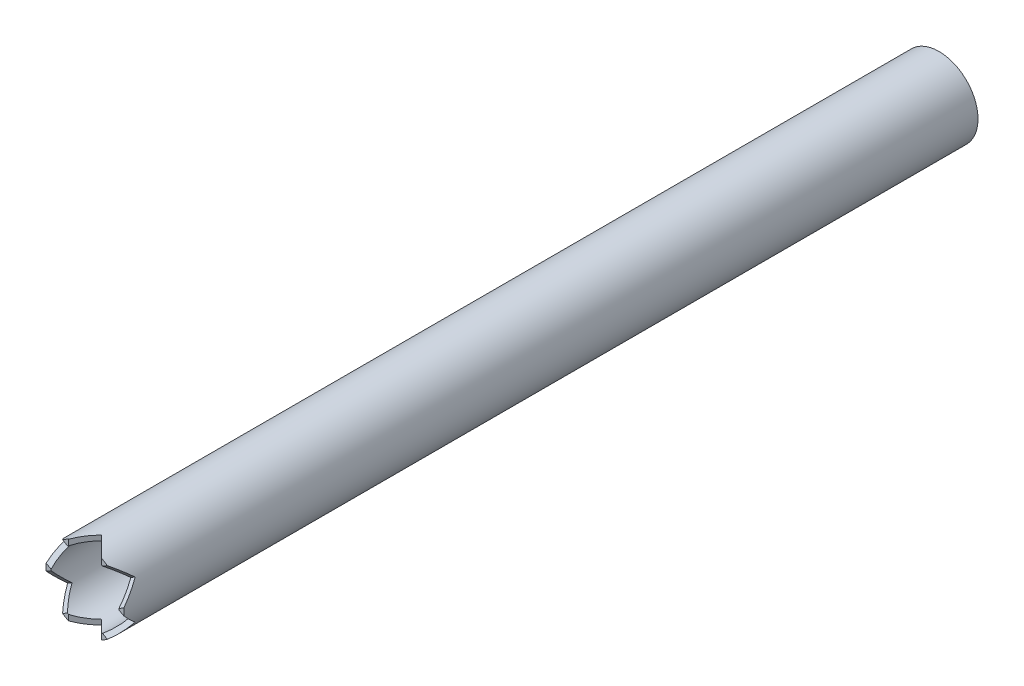
ISO-10303-21;
HEADER;
FILE_DESCRIPTION(('STEP AP214'),'2;1');
FILE_NAME('part.step','',(''),(''),'','','');
FILE_SCHEMA(('AUTOMOTIVE_DESIGN { 1 0 10303 214 1 1 1 1 }'));
ENDSEC;
DATA;
#1=APPLICATION_CONTEXT('core data for automotive mechanical design processes');
#2=APPLICATION_PROTOCOL_DEFINITION('international standard','automotive_design',2000,#1);
#3=PRODUCT_CONTEXT('',#1,'mechanical');
#4=PRODUCT('Part','Part','',(#3));
#5=PRODUCT_RELATED_PRODUCT_CATEGORY('part','',(#4));
#6=PRODUCT_DEFINITION_FORMATION('','',#4);
#7=PRODUCT_DEFINITION_CONTEXT('part definition',#1,'design');
#8=PRODUCT_DEFINITION('design','',#6,#7);
#9=PRODUCT_DEFINITION_SHAPE('','',#8);
#10=(LENGTH_UNIT() NAMED_UNIT(*) SI_UNIT(.MILLI.,.METRE.));
#11=(NAMED_UNIT(*) PLANE_ANGLE_UNIT() SI_UNIT($,.RADIAN.));
#12=(NAMED_UNIT(*) SI_UNIT($,.STERADIAN.) SOLID_ANGLE_UNIT());
#13=UNCERTAINTY_MEASURE_WITH_UNIT(LENGTH_MEASURE(1.E-05),#10,'distance_accuracy_value','');
#14=(GEOMETRIC_REPRESENTATION_CONTEXT(3) GLOBAL_UNCERTAINTY_ASSIGNED_CONTEXT((#13)) GLOBAL_UNIT_ASSIGNED_CONTEXT((#10,
#11,#12)) REPRESENTATION_CONTEXT('',''));
#15=CARTESIAN_POINT('',(0.,0.,0.));
#16=DIRECTION('',(0.,0.,1.));
#17=DIRECTION('',(1.,0.,0.));
#18=AXIS2_PLACEMENT_3D('',#15,#16,#17);
#19=CARTESIAN_POINT('',(0.,0.,0.));
#20=DIRECTION('',(0.,0.,-1.));
#21=DIRECTION('',(-1.,0.,0.));
#22=AXIS2_PLACEMENT_3D('',#19,#20,#21);
#23=PLANE('',#22);
#24=CARTESIAN_POINT('',(0.,0.,0.));
#25=DIRECTION('',(0.,0.,-1.));
#26=DIRECTION('',(-1.,0.,0.));
#27=AXIS2_PLACEMENT_3D('',#24,#25,#26);
#28=CIRCLE('',#27,30.1625);
#29=CARTESIAN_POINT('',(30.0431383461014,2.68071717400603,0.));
#30=VERTEX_POINT('',#29);
#31=CARTESIAN_POINT('',(30.0431383461014,-2.68071717400645,0.));
#32=VERTEX_POINT('',#31);
#33=EDGE_CURVE('E264',#30,#32,#28,.T.);
#34=ORIENTED_EDGE('',*,*,#33,.F.);
#35=DIRECTION('',(-0.866025403784443,-0.499999999999992,0.));
#36=VECTOR('',#35,1.);
#37=CARTESIAN_POINT('',(42.0326206208241,9.60284799276126,0.));
#38=LINE('',#37,#36);
#39=CARTESIAN_POINT('',(26.2463517537135,0.488641412835382,0.));
#40=VERTEX_POINT('',#39);
#41=EDGE_CURVE('E353',#30,#40,#38,.T.);
#42=ORIENTED_EDGE('',*,*,#41,.T.);
#43=CARTESIAN_POINT('',(0.,0.,0.));
#44=DIRECTION('',(0.,0.,-1.));
#45=DIRECTION('',(-1.,0.,0.));
#46=AXIS2_PLACEMENT_3D('',#43,#44,#45);
#47=CIRCLE('',#46,26.2509);
#48=CARTESIAN_POINT('',(26.2463517537135,-0.48864141283575,0.));
#49=VERTEX_POINT('',#48);
#50=EDGE_CURVE('E197',#40,#49,#47,.T.);
#51=ORIENTED_EDGE('',*,*,#50,.T.);
#52=DIRECTION('',(0.866025403784436,-0.500000000000004,0.));
#53=VECTOR('',#52,1.);
#54=CARTESIAN_POINT('',(-29.332620620824,31.5998932488866,0.));
#55=LINE('',#54,#53);
#56=EDGE_CURVE('E201',#49,#32,#55,.T.);
#57=ORIENTED_EDGE('',*,*,#56,.T.);
#58=EDGE_LOOP('',(#34,#42,#51,#57));
#59=FACE_BOUND('',#58,.T.);
#60=ADVANCED_FACE('F51',(#59),#23,.F.);
#61=CARTESIAN_POINT('',(-12.7,-22.974328081796,0.));
#62=VERTEX_POINT('',#61);
#63=CARTESIAN_POINT('',(-13.5463517537138,-22.4856866689602,0.));
#64=VERTEX_POINT('',#63);
#65=EDGE_CURVE('E253',#62,#64,#47,.T.);
#66=ORIENTED_EDGE('',*,*,#65,.T.);
#67=DIRECTION('',(-0.866025403784443,-0.499999999999992,0.));
#68=VECTOR('',#67,1.);
#69=CARTESIAN_POINT('',(6.3499999999999,-10.9985226280624,0.));
#70=LINE('',#69,#68);
#71=CARTESIAN_POINT('',(-17.3431383461016,-24.6777624301309,0.));
#72=VERTEX_POINT('',#71);
#73=EDGE_CURVE('E14',#64,#72,#70,.T.);
#74=ORIENTED_EDGE('',*,*,#73,.T.);
#75=CARTESIAN_POINT('',(-12.7,-27.3584796041374,0.));
#76=VERTEX_POINT('',#75);
#77=EDGE_CURVE('E259',#76,#72,#28,.T.);
#78=ORIENTED_EDGE('',*,*,#77,.F.);
#79=DIRECTION('',(0.,1.,0.));
#80=VECTOR('',#79,1.);
#81=CARTESIAN_POINT('',(-12.7,0.,0.));
#82=LINE('',#81,#80);
#83=EDGE_CURVE('E267',#76,#62,#82,.T.);
#84=ORIENTED_EDGE('',*,*,#83,.T.);
#85=EDGE_LOOP('',(#66,#74,#78,#84));
#86=FACE_BOUND('',#85,.T.);
#87=ADVANCED_FACE('F308',(#86),#23,.F.);
#88=CARTESIAN_POINT('',(12.7,22.974328081796,0.));
#89=VERTEX_POINT('',#88);
#90=CARTESIAN_POINT('',(13.5463517537138,22.4856866689602,0.));
#91=VERTEX_POINT('',#90);
#92=EDGE_CURVE('E258',#89,#91,#47,.T.);
#93=ORIENTED_EDGE('',*,*,#92,.T.);
#94=DIRECTION('',(-0.866025403784443,-0.499999999999992,0.));
#95=VECTOR('',#94,1.);
#96=CARTESIAN_POINT('',(29.3326206208243,31.5998932488861,0.));
#97=LINE('',#96,#95);
#98=CARTESIAN_POINT('',(17.3431383461016,24.6777624301309,0.));
#99=VERTEX_POINT('',#98);
#100=EDGE_CURVE('E178',#99,#91,#97,.T.);
#101=ORIENTED_EDGE('',*,*,#100,.F.);
#102=CARTESIAN_POINT('',(12.7,27.3584796041374,0.));
#103=VERTEX_POINT('',#102);
#104=EDGE_CURVE('E249',#103,#99,#28,.T.);
#105=ORIENTED_EDGE('',*,*,#104,.F.);
#106=DIRECTION('',(0.,-1.,0.));
#107=VECTOR('',#106,1.);
#108=CARTESIAN_POINT('',(12.7,0.,0.));
#109=LINE('',#108,#107);
#110=EDGE_CURVE('E271',#103,#89,#109,.T.);
#111=ORIENTED_EDGE('',*,*,#110,.T.);
#112=EDGE_LOOP('',(#93,#101,#105,#111));
#113=FACE_BOUND('',#112,.T.);
#114=ADVANCED_FACE('F313',(#113),#23,.F.);
#115=CARTESIAN_POINT('',(-17.3431383461013,24.6777624301311,0.));
#116=VERTEX_POINT('',#115);
#117=CARTESIAN_POINT('',(-12.7,27.3584796041374,0.));
#118=VERTEX_POINT('',#117);
#119=EDGE_CURVE('E289',#116,#118,#28,.T.);
#120=ORIENTED_EDGE('',*,*,#119,.F.);
#121=DIRECTION('',(0.866025403784436,-0.500000000000004,0.));
#122=VECTOR('',#121,1.);
#123=CARTESIAN_POINT('',(6.35000000000005,10.9985226280623,0.));
#124=LINE('',#123,#122);
#125=CARTESIAN_POINT('',(-13.5463517537134,22.4856866689604,0.));
#126=VERTEX_POINT('',#125);
#127=EDGE_CURVE('E275',#116,#126,#124,.T.);
#128=ORIENTED_EDGE('',*,*,#127,.T.);
#129=CARTESIAN_POINT('',(-12.7,22.974328081796,0.));
#130=VERTEX_POINT('',#129);
#131=EDGE_CURVE('E286',#126,#130,#47,.T.);
#132=ORIENTED_EDGE('',*,*,#131,.T.);
#133=EDGE_CURVE('E252',#130,#118,#82,.T.);
#134=ORIENTED_EDGE('',*,*,#133,.T.);
#135=EDGE_LOOP('',(#120,#128,#132,#134));
#136=FACE_BOUND('',#135,.T.);
#137=ADVANCED_FACE('F330',(#136),#23,.F.);
#138=CARTESIAN_POINT('',(17.3431383461013,-24.6777624301311,0.));
#139=VERTEX_POINT('',#138);
#140=CARTESIAN_POINT('',(12.7,-27.3584796041374,0.));
#141=VERTEX_POINT('',#140);
#142=EDGE_CURVE('E262',#139,#141,#28,.T.);
#143=ORIENTED_EDGE('',*,*,#142,.F.);
#144=DIRECTION('',(0.866025403784436,-0.500000000000004,0.));
#145=VECTOR('',#144,1.);
#146=CARTESIAN_POINT('',(-42.0326206208241,9.60284799276193,0.));
#147=LINE('',#146,#145);
#148=CARTESIAN_POINT('',(13.5463517537135,-22.4856866689604,0.));
#149=VERTEX_POINT('',#148);
#150=EDGE_CURVE('E209',#149,#139,#147,.T.);
#151=ORIENTED_EDGE('',*,*,#150,.F.);
#152=CARTESIAN_POINT('',(12.7,-22.974328081796,0.));
#153=VERTEX_POINT('',#152);
#154=EDGE_CURVE('E256',#149,#153,#47,.T.);
#155=ORIENTED_EDGE('',*,*,#154,.T.);
#156=EDGE_CURVE('E268',#153,#141,#109,.T.);
#157=ORIENTED_EDGE('',*,*,#156,.T.);
#158=EDGE_LOOP('',(#143,#151,#155,#157));
#159=FACE_BOUND('',#158,.T.);
#160=ADVANCED_FACE('F319',(#159),#23,.F.);
#161=CARTESIAN_POINT('',(0.,0.,-660.4));
#162=DIRECTION('',(0.,0.,1.));
#163=DIRECTION('',(1.,0.,0.));
#164=AXIS2_PLACEMENT_3D('',#161,#162,#163);
#165=CYLINDRICAL_SURFACE('',#164,26.2509);
#166=CARTESIAN_POINT('',(0.,0.,-12.7));
#167=DIRECTION('',(0.353553390593268,-0.612372435695798,-0.707106781186548));
#168=DIRECTION('',(0.353553390593268,-0.612372435695798,0.707106781186548));
#169=AXIS2_PLACEMENT_3D('',#166,#167,#168);
#170=ELLIPSE('',#169,37.1243788044999,26.2509);
#171=CARTESIAN_POINT('',(22.733946272205,13.1254499999998,-12.7));
#172=VERTEX_POINT('',#171);
#173=EDGE_CURVE('E187',#172,#40,#170,.T.);
#174=ORIENTED_EDGE('',*,*,#173,.F.);
#175=CARTESIAN_POINT('',(0.,0.,-12.7));
#176=DIRECTION('',(-0.353553390593268,0.612372435695798,-0.707106781186548));
#177=DIRECTION('',(-0.353553390593268,0.612372435695798,0.707106781186548));
#178=AXIS2_PLACEMENT_3D('',#175,#176,#177);
#179=ELLIPSE('',#178,37.1243788044999,26.2509);
#180=EDGE_CURVE('E175',#91,#172,#179,.T.);
#181=ORIENTED_EDGE('',*,*,#180,.F.);
#182=ORIENTED_EDGE('',*,*,#92,.F.);
#183=CARTESIAN_POINT('',(0.,0.,-12.7));
#184=DIRECTION('',(0.707106781186548,0.,-0.707106781186548));
#185=DIRECTION('',(0.707106781186548,0.,0.707106781186548));
#186=AXIS2_PLACEMENT_3D('',#183,#184,#185);
#187=ELLIPSE('',#186,37.1243788044999,26.2509);
#188=CARTESIAN_POINT('',(0.,26.2509,-12.7));
#189=VERTEX_POINT('',#188);
#190=EDGE_CURVE('E242',#189,#89,#187,.T.);
#191=ORIENTED_EDGE('',*,*,#190,.F.);
#192=CARTESIAN_POINT('',(0.,0.,-12.7));
#193=DIRECTION('',(-0.707106781186548,0.,-0.707106781186548));
#194=DIRECTION('',(-0.707106781186548,0.,0.707106781186548));
#195=AXIS2_PLACEMENT_3D('',#192,#193,#194);
#196=ELLIPSE('',#195,37.1243788044999,26.2509);
#197=EDGE_CURVE('E237',#130,#189,#196,.T.);
#198=ORIENTED_EDGE('',*,*,#197,.F.);
#199=ORIENTED_EDGE('',*,*,#131,.F.);
#200=CARTESIAN_POINT('',(0.,0.,-12.7));
#201=DIRECTION('',(0.353553390593277,0.612372435695793,-0.707106781186548));
#202=DIRECTION('',(0.353553390593277,0.612372435695793,0.707106781186547));
#203=AXIS2_PLACEMENT_3D('',#200,#201,#202);
#204=ELLIPSE('',#203,37.1243788044999,26.2509);
#205=CARTESIAN_POINT('',(-22.7339462722049,13.1254500000001,-12.7));
#206=VERTEX_POINT('',#205);
#207=EDGE_CURVE('E224',#206,#126,#204,.T.);
#208=ORIENTED_EDGE('',*,*,#207,.F.);
#209=CARTESIAN_POINT('',(0.,0.,-12.7));
#210=DIRECTION('',(-0.353553390593277,-0.612372435695793,-0.707106781186548));
#211=DIRECTION('',(-0.353553390593277,-0.612372435695793,0.707106781186547));
#212=AXIS2_PLACEMENT_3D('',#209,#210,#211);
#213=ELLIPSE('',#212,37.1243788044999,26.2509);
#214=CARTESIAN_POINT('',(-26.2463517537135,0.48864141283575,0.));
#215=VERTEX_POINT('',#214);
#216=EDGE_CURVE('E219',#215,#206,#213,.T.);
#217=ORIENTED_EDGE('',*,*,#216,.F.);
#218=CARTESIAN_POINT('',(-26.2463517537135,-0.488641412835389,0.));
#219=VERTEX_POINT('',#218);
#220=EDGE_CURVE('E257',#219,#215,#47,.T.);
#221=ORIENTED_EDGE('',*,*,#220,.F.);
#222=CARTESIAN_POINT('',(-22.733946272205,-13.1254499999998,-12.7));
#223=VERTEX_POINT('',#222);
#224=EDGE_CURVE('E74',#223,#219,#179,.T.);
#225=ORIENTED_EDGE('',*,*,#224,.F.);
#226=EDGE_CURVE('E198',#64,#223,#170,.T.);
#227=ORIENTED_EDGE('',*,*,#226,.F.);
#228=ORIENTED_EDGE('',*,*,#65,.F.);
#229=CARTESIAN_POINT('',(0.,-26.2509,-12.7));
#230=VERTEX_POINT('',#229);
#231=EDGE_CURVE('E235',#230,#62,#196,.T.);
#232=ORIENTED_EDGE('',*,*,#231,.F.);
#233=EDGE_CURVE('E244',#153,#230,#187,.T.);
#234=ORIENTED_EDGE('',*,*,#233,.F.);
#235=ORIENTED_EDGE('',*,*,#154,.F.);
#236=CARTESIAN_POINT('',(22.7339462722048,-13.1254500000001,-12.7));
#237=VERTEX_POINT('',#236);
#238=EDGE_CURVE('E217',#237,#149,#213,.T.);
#239=ORIENTED_EDGE('',*,*,#238,.F.);
#240=EDGE_CURVE('E226',#49,#237,#204,.T.);
#241=ORIENTED_EDGE('',*,*,#240,.F.);
#242=ORIENTED_EDGE('',*,*,#50,.F.);
#243=EDGE_LOOP('',(#174,#181,#182,#191,#198,#199,#208,#217,#221,#225,#227,#228,#232,#234,#235,
#239,#241,#242));
#244=FACE_BOUND('',#243,.T.);
#245=CARTESIAN_POINT('',(0.,0.,-660.4));
#246=DIRECTION('',(0.,0.,-1.));
#247=DIRECTION('',(-1.,0.,0.));
#248=AXIS2_PLACEMENT_3D('',#245,#246,#247);
#249=CIRCLE('',#248,26.2509);
#250=CARTESIAN_POINT('',(-26.2509,0.,-660.4));
#251=VERTEX_POINT('',#250);
#252=EDGE_CURVE('E245',#251,#251,#249,.T.);
#253=ORIENTED_EDGE('',*,*,#252,.T.);
#254=EDGE_LOOP('',(#253));
#255=FACE_BOUND('',#254,.T.);
#256=ADVANCED_FACE('F53',(#244,#255),#165,.F.);
#257=CARTESIAN_POINT('',(0.,0.,-660.4));
#258=DIRECTION('',(0.,0.,1.));
#259=DIRECTION('',(1.,0.,0.));
#260=AXIS2_PLACEMENT_3D('',#257,#258,#259);
#261=CYLINDRICAL_SURFACE('',#260,30.1625);
#262=CARTESIAN_POINT('',(0.,0.,-660.4));
#263=DIRECTION('',(0.,0.,-1.));
#264=DIRECTION('',(-1.,0.,0.));
#265=AXIS2_PLACEMENT_3D('',#262,#263,#264);
#266=CIRCLE('',#265,30.1625);
#267=CARTESIAN_POINT('',(-30.1625,0.,-660.4));
#268=VERTEX_POINT('',#267);
#269=EDGE_CURVE('E248',#268,#268,#266,.T.);
#270=ORIENTED_EDGE('',*,*,#269,.F.);
#271=EDGE_LOOP('',(#270));
#272=FACE_BOUND('',#271,.T.);
#273=CARTESIAN_POINT('',(0.,0.,-12.7));
#274=DIRECTION('',(-0.353553390593268,0.612372435695798,-0.707106781186548));
#275=DIRECTION('',(-0.353553390593268,0.612372435695798,0.707106781186548));
#276=AXIS2_PLACEMENT_3D('',#273,#274,#275);
#277=ELLIPSE('',#276,42.6562165750785,30.1625);
#278=CARTESIAN_POINT('',(26.1214912416483,15.0812499999998,-12.7));
#279=VERTEX_POINT('',#278);
#280=EDGE_CURVE('E357',#99,#279,#277,.T.);
#281=ORIENTED_EDGE('',*,*,#280,.T.);
#282=CARTESIAN_POINT('',(0.,0.,-12.7));
#283=DIRECTION('',(0.353553390593268,-0.612372435695798,-0.707106781186548));
#284=DIRECTION('',(0.353553390593268,-0.612372435695798,0.707106781186548));
#285=AXIS2_PLACEMENT_3D('',#282,#283,#284);
#286=ELLIPSE('',#285,42.6562165750785,30.1625);
#287=EDGE_CURVE('E183',#279,#30,#286,.T.);
#288=ORIENTED_EDGE('',*,*,#287,.T.);
#289=ORIENTED_EDGE('',*,*,#33,.T.);
#290=CARTESIAN_POINT('',(0.,0.,-12.7));
#291=DIRECTION('',(0.353553390593277,0.612372435695793,-0.707106781186548));
#292=DIRECTION('',(0.353553390593277,0.612372435695793,0.707106781186547));
#293=AXIS2_PLACEMENT_3D('',#290,#291,#292);
#294=ELLIPSE('',#293,42.6562165750785,30.1625);
#295=CARTESIAN_POINT('',(26.1214912416481,-15.0812500000001,-12.7));
#296=VERTEX_POINT('',#295);
#297=EDGE_CURVE('E223',#32,#296,#294,.T.);
#298=ORIENTED_EDGE('',*,*,#297,.T.);
#299=CARTESIAN_POINT('',(0.,0.,-12.7));
#300=DIRECTION('',(-0.353553390593277,-0.612372435695793,-0.707106781186548));
#301=DIRECTION('',(-0.353553390593277,-0.612372435695793,0.707106781186547));
#302=AXIS2_PLACEMENT_3D('',#299,#300,#301);
#303=ELLIPSE('',#302,42.6562165750785,30.1625);
#304=EDGE_CURVE('E213',#296,#139,#303,.T.);
#305=ORIENTED_EDGE('',*,*,#304,.T.);
#306=ORIENTED_EDGE('',*,*,#142,.T.);
#307=CARTESIAN_POINT('',(0.,0.,-12.7));
#308=DIRECTION('',(0.707106781186548,0.,-0.707106781186548));
#309=DIRECTION('',(0.707106781186548,0.,0.707106781186548));
#310=AXIS2_PLACEMENT_3D('',#307,#308,#309);
#311=ELLIPSE('',#310,42.6562165750785,30.1625);
#312=CARTESIAN_POINT('',(0.,-30.1625,-12.7));
#313=VERTEX_POINT('',#312);
#314=EDGE_CURVE('E241',#141,#313,#311,.T.);
#315=ORIENTED_EDGE('',*,*,#314,.T.);
#316=CARTESIAN_POINT('',(0.,0.,-12.7));
#317=DIRECTION('',(-0.707106781186548,0.,-0.707106781186548));
#318=DIRECTION('',(-0.707106781186548,0.,0.707106781186548));
#319=AXIS2_PLACEMENT_3D('',#316,#317,#318);
#320=ELLIPSE('',#319,42.6562165750785,30.1625);
#321=EDGE_CURVE('E230',#313,#76,#320,.T.);
#322=ORIENTED_EDGE('',*,*,#321,.T.);
#323=ORIENTED_EDGE('',*,*,#77,.T.);
#324=CARTESIAN_POINT('',(-26.1214912416483,-15.0812499999998,-12.7));
#325=VERTEX_POINT('',#324);
#326=EDGE_CURVE('E199',#72,#325,#286,.T.);
#327=ORIENTED_EDGE('',*,*,#326,.T.);
#328=CARTESIAN_POINT('',(-30.0431383461014,-2.68071717400603,0.));
#329=VERTEX_POINT('',#328);
#330=EDGE_CURVE('E191',#325,#329,#277,.T.);
#331=ORIENTED_EDGE('',*,*,#330,.T.);
#332=CARTESIAN_POINT('',(-30.0431383461014,2.68071717400645,0.));
#333=VERTEX_POINT('',#332);
#334=EDGE_CURVE('E263',#329,#333,#28,.T.);
#335=ORIENTED_EDGE('',*,*,#334,.T.);
#336=CARTESIAN_POINT('',(-26.1214912416481,15.0812500000001,-12.7));
#337=VERTEX_POINT('',#336);
#338=EDGE_CURVE('E216',#333,#337,#303,.T.);
#339=ORIENTED_EDGE('',*,*,#338,.T.);
#340=EDGE_CURVE('E220',#337,#116,#294,.T.);
#341=ORIENTED_EDGE('',*,*,#340,.T.);
#342=ORIENTED_EDGE('',*,*,#119,.T.);
#343=CARTESIAN_POINT('',(0.,30.1625,-12.7));
#344=VERTEX_POINT('',#343);
#345=EDGE_CURVE('E234',#118,#344,#320,.T.);
#346=ORIENTED_EDGE('',*,*,#345,.T.);
#347=EDGE_CURVE('E238',#344,#103,#311,.T.);
#348=ORIENTED_EDGE('',*,*,#347,.T.);
#349=ORIENTED_EDGE('',*,*,#104,.T.);
#350=EDGE_LOOP('',(#281,#288,#289,#298,#305,#306,#315,#322,#323,#327,#331,#335,#339,#341,#342,
#346,#348,#349));
#351=FACE_BOUND('',#350,.T.);
#352=ADVANCED_FACE('F303',(#272,#351),#261,.T.);
#353=CARTESIAN_POINT('',(0.,0.,-660.4));
#354=DIRECTION('',(0.,0.,-1.));
#355=DIRECTION('',(-1.,0.,0.));
#356=AXIS2_PLACEMENT_3D('',#353,#354,#355);
#357=PLANE('',#356);
#358=ORIENTED_EDGE('',*,*,#252,.F.);
#359=EDGE_LOOP('',(#358));
#360=FACE_BOUND('',#359,.T.);
#361=ORIENTED_EDGE('',*,*,#269,.T.);
#362=EDGE_LOOP('',(#361));
#363=FACE_BOUND('',#362,.T.);
#364=ADVANCED_FACE('F318',(#360,#363),#357,.T.);
#365=ORIENTED_EDGE('',*,*,#334,.F.);
#366=DIRECTION('',(0.866025403784443,0.499999999999992,0.));
#367=VECTOR('',#366,1.);
#368=CARTESIAN_POINT('',(-6.3499999999999,10.9985226280624,0.));
#369=LINE('',#368,#367);
#370=EDGE_CURVE('E59',#329,#219,#369,.T.);
#371=ORIENTED_EDGE('',*,*,#370,.T.);
#372=ORIENTED_EDGE('',*,*,#220,.T.);
#373=DIRECTION('',(-0.866025403784436,0.500000000000004,0.));
#374=VECTOR('',#373,1.);
#375=CARTESIAN_POINT('',(-6.35000000000005,-10.9985226280623,0.));
#376=LINE('',#375,#374);
#377=EDGE_CURVE('E272',#215,#333,#376,.T.);
#378=ORIENTED_EDGE('',*,*,#377,.T.);
#379=EDGE_LOOP('',(#365,#371,#372,#378));
#380=FACE_BOUND('',#379,.T.);
#381=ADVANCED_FACE('F280',(#380),#23,.F.);
#382=CARTESIAN_POINT('',(0.,-30.1625,-12.7));
#383=DIRECTION('',(-0.707106781186548,0.,-0.707106781186548));
#384=DIRECTION('',(-0.707106781186548,0.,0.707106781186548));
#385=AXIS2_PLACEMENT_3D('',#382,#383,#384);
#386=PLANE('',#385);
#387=ORIENTED_EDGE('',*,*,#197,.T.);
#388=DIRECTION('',(0.,1.,0.));
#389=VECTOR('',#388,1.);
#390=CARTESIAN_POINT('',(0.,-30.1625,-12.7));
#391=LINE('',#390,#389);
#392=EDGE_CURVE('E231',#189,#344,#391,.T.);
#393=ORIENTED_EDGE('',*,*,#392,.T.);
#394=ORIENTED_EDGE('',*,*,#345,.F.);
#395=ORIENTED_EDGE('',*,*,#133,.F.);
#396=EDGE_LOOP('',(#387,#393,#394,#395));
#397=FACE_BOUND('',#396,.T.);
#398=ADVANCED_FACE('F317',(#397),#386,.F.);
#399=CARTESIAN_POINT('',(12.7,-30.1625,0.));
#400=DIRECTION('',(0.707106781186548,0.,-0.707106781186548));
#401=DIRECTION('',(-0.707106781186548,0.,-0.707106781186548));
#402=AXIS2_PLACEMENT_3D('',#399,#400,#401);
#403=PLANE('',#402);
#404=ORIENTED_EDGE('',*,*,#190,.T.);
#405=ORIENTED_EDGE('',*,*,#110,.F.);
#406=ORIENTED_EDGE('',*,*,#347,.F.);
#407=ORIENTED_EDGE('',*,*,#392,.F.);
#408=EDGE_LOOP('',(#404,#405,#406,#407));
#409=FACE_BOUND('',#408,.T.);
#410=ADVANCED_FACE('F324',(#409),#403,.F.);
#411=ORIENTED_EDGE('',*,*,#233,.T.);
#412=EDGE_CURVE('E227',#313,#230,#391,.T.);
#413=ORIENTED_EDGE('',*,*,#412,.F.);
#414=ORIENTED_EDGE('',*,*,#314,.F.);
#415=ORIENTED_EDGE('',*,*,#156,.F.);
#416=EDGE_LOOP('',(#411,#413,#414,#415));
#417=FACE_BOUND('',#416,.T.);
#418=ADVANCED_FACE('F342',(#417),#403,.F.);
#419=ORIENTED_EDGE('',*,*,#231,.T.);
#420=ORIENTED_EDGE('',*,*,#83,.F.);
#421=ORIENTED_EDGE('',*,*,#321,.F.);
#422=ORIENTED_EDGE('',*,*,#412,.T.);
#423=EDGE_LOOP('',(#419,#420,#421,#422));
#424=FACE_BOUND('',#423,.T.);
#425=ADVANCED_FACE('F327',(#424),#386,.F.);
#426=CARTESIAN_POINT('',(-42.0326206208241,9.60284799276193,0.));
#427=DIRECTION('',(-0.353553390593277,-0.612372435695793,-0.707106781186548));
#428=DIRECTION('',(0.,0.755928946018455,-0.654653670707976));
#429=AXIS2_PLACEMENT_3D('',#426,#427,#428);
#430=PLANE('',#429);
#431=ORIENTED_EDGE('',*,*,#216,.T.);
#432=DIRECTION('',(0.866025403784436,-0.500000000000004,0.));
#433=VECTOR('',#432,1.);
#434=CARTESIAN_POINT('',(-35.682620620824,20.6013706208243,-12.7));
#435=LINE('',#434,#433);
#436=EDGE_CURVE('E208',#337,#206,#435,.T.);
#437=ORIENTED_EDGE('',*,*,#436,.F.);
#438=ORIENTED_EDGE('',*,*,#338,.F.);
#439=ORIENTED_EDGE('',*,*,#377,.F.);
#440=EDGE_LOOP('',(#431,#437,#438,#439));
#441=FACE_BOUND('',#440,.T.);
#442=ADVANCED_FACE('F370',(#441),#430,.F.);
#443=CARTESIAN_POINT('',(-35.682620620824,20.6013706208243,-12.7));
#444=DIRECTION('',(0.353553390593277,0.612372435695793,-0.707106781186548));
#445=DIRECTION('',(0.,0.755928946018455,0.654653670707976));
#446=AXIS2_PLACEMENT_3D('',#443,#444,#445);
#447=PLANE('',#446);
#448=ORIENTED_EDGE('',*,*,#207,.T.);
#449=ORIENTED_EDGE('',*,*,#127,.F.);
#450=ORIENTED_EDGE('',*,*,#340,.F.);
#451=ORIENTED_EDGE('',*,*,#436,.T.);
#452=EDGE_LOOP('',(#448,#449,#450,#451));
#453=FACE_BOUND('',#452,.T.);
#454=ADVANCED_FACE('F376',(#453),#447,.F.);
#455=ORIENTED_EDGE('',*,*,#240,.T.);
#456=EDGE_CURVE('E205',#237,#296,#435,.T.);
#457=ORIENTED_EDGE('',*,*,#456,.T.);
#458=ORIENTED_EDGE('',*,*,#297,.F.);
#459=ORIENTED_EDGE('',*,*,#56,.F.);
#460=EDGE_LOOP('',(#455,#457,#458,#459));
#461=FACE_BOUND('',#460,.T.);
#462=ADVANCED_FACE('F305',(#461),#447,.F.);
#463=ORIENTED_EDGE('',*,*,#238,.T.);
#464=ORIENTED_EDGE('',*,*,#150,.T.);
#465=ORIENTED_EDGE('',*,*,#304,.F.);
#466=ORIENTED_EDGE('',*,*,#456,.F.);
#467=EDGE_LOOP('',(#463,#464,#465,#466));
#468=FACE_BOUND('',#467,.T.);
#469=ADVANCED_FACE('F366',(#468),#430,.F.);
#470=CARTESIAN_POINT('',(29.3326206208243,31.5998932488861,0.));
#471=DIRECTION('',(-0.353553390593268,0.612372435695798,-0.707106781186548));
#472=DIRECTION('',(0.,0.755928946018453,0.654653670707979));
#473=AXIS2_PLACEMENT_3D('',#470,#471,#472);
#474=PLANE('',#473);
#475=ORIENTED_EDGE('',*,*,#224,.T.);
#476=ORIENTED_EDGE('',*,*,#370,.F.);
#477=ORIENTED_EDGE('',*,*,#330,.F.);
#478=DIRECTION('',(-0.866025403784443,-0.499999999999992,0.));
#479=VECTOR('',#478,1.);
#480=CARTESIAN_POINT('',(35.6826206208242,20.6013706208237,-12.7));
#481=LINE('',#480,#479);
#482=EDGE_CURVE('E192',#223,#325,#481,.T.);
#483=ORIENTED_EDGE('',*,*,#482,.F.);
#484=EDGE_LOOP('',(#475,#476,#477,#483));
#485=FACE_BOUND('',#484,.T.);
#486=ADVANCED_FACE('F368',(#485),#474,.F.);
#487=CARTESIAN_POINT('',(35.6826206208242,20.6013706208237,-12.7));
#488=DIRECTION('',(0.353553390593268,-0.612372435695798,-0.707106781186548));
#489=DIRECTION('',(0.,0.755928946018453,-0.654653670707979));
#490=AXIS2_PLACEMENT_3D('',#487,#488,#489);
#491=PLANE('',#490);
#492=ORIENTED_EDGE('',*,*,#226,.T.);
#493=ORIENTED_EDGE('',*,*,#482,.T.);
#494=ORIENTED_EDGE('',*,*,#326,.F.);
#495=ORIENTED_EDGE('',*,*,#73,.F.);
#496=EDGE_LOOP('',(#492,#493,#494,#495));
#497=FACE_BOUND('',#496,.T.);
#498=ADVANCED_FACE('F352',(#497),#491,.F.);
#499=ORIENTED_EDGE('',*,*,#173,.T.);
#500=ORIENTED_EDGE('',*,*,#41,.F.);
#501=ORIENTED_EDGE('',*,*,#287,.F.);
#502=EDGE_CURVE('E66',#279,#172,#481,.T.);
#503=ORIENTED_EDGE('',*,*,#502,.T.);
#504=EDGE_LOOP('',(#499,#500,#501,#503));
#505=FACE_BOUND('',#504,.T.);
#506=ADVANCED_FACE('F186',(#505),#491,.F.);
#507=ORIENTED_EDGE('',*,*,#180,.T.);
#508=ORIENTED_EDGE('',*,*,#502,.F.);
#509=ORIENTED_EDGE('',*,*,#280,.F.);
#510=ORIENTED_EDGE('',*,*,#100,.T.);
#511=EDGE_LOOP('',(#507,#508,#509,#510));
#512=FACE_BOUND('',#511,.T.);
#513=ADVANCED_FACE('F176',(#512),#474,.F.);
#514=CLOSED_SHELL('',(#60,#87,#114,#137,#160,#256,#352,#364,#381,#398,#410,#418,#425,#442,#454,
#462,#469,#486,#498,#506,#513));
#515=MANIFOLD_SOLID_BREP('B2',#514);
#516=ADVANCED_BREP_SHAPE_REPRESENTATION('',(#18,#515),#14);
#517=SHAPE_DEFINITION_REPRESENTATION(#9,#516);
ENDSEC;
END-ISO-10303-21;
